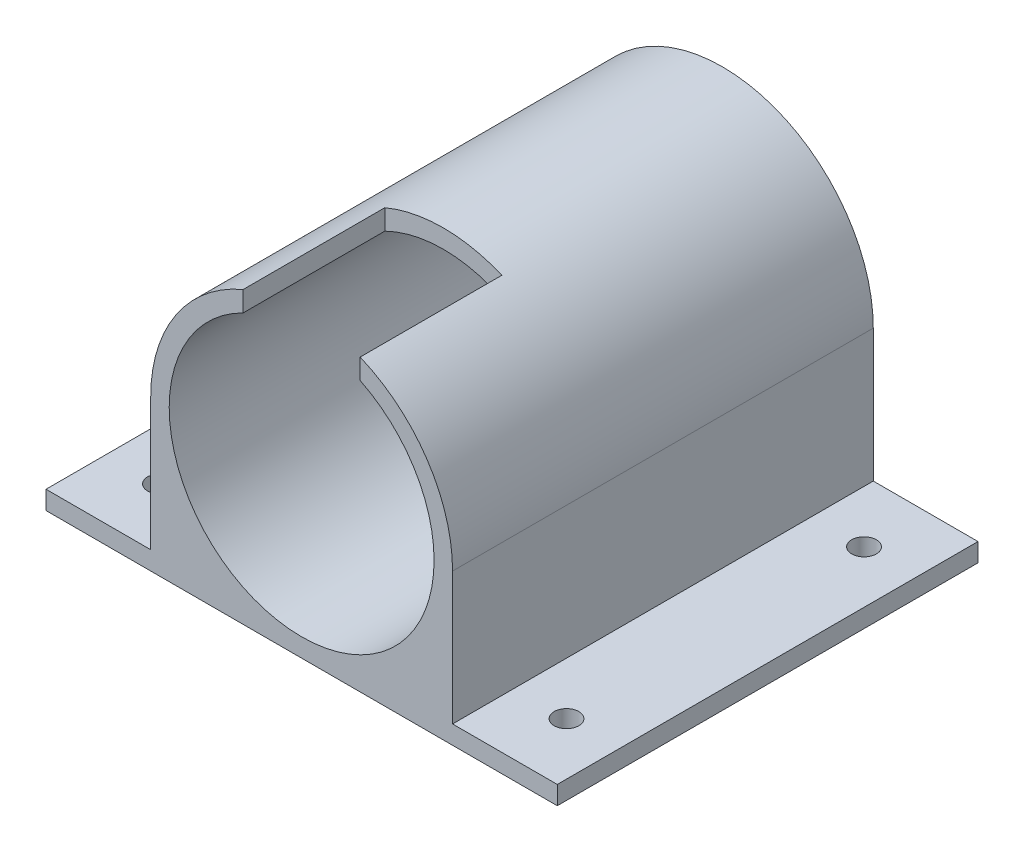
ISO-10303-21;
HEADER;
FILE_DESCRIPTION(('STEP AP214'),'2;1');
FILE_NAME('part.step','',(''),(''),'','','');
FILE_SCHEMA(('AUTOMOTIVE_DESIGN { 1 0 10303 214 1 1 1 1 }'));
ENDSEC;
DATA;
#1=APPLICATION_CONTEXT('core data for automotive mechanical design processes');
#2=APPLICATION_PROTOCOL_DEFINITION('international standard','automotive_design',2000,#1);
#3=PRODUCT_CONTEXT('',#1,'mechanical');
#4=PRODUCT('Part','Part','',(#3));
#5=PRODUCT_RELATED_PRODUCT_CATEGORY('part','',(#4));
#6=PRODUCT_DEFINITION_FORMATION('','',#4);
#7=PRODUCT_DEFINITION_CONTEXT('part definition',#1,'design');
#8=PRODUCT_DEFINITION('design','',#6,#7);
#9=PRODUCT_DEFINITION_SHAPE('','',#8);
#10=(LENGTH_UNIT() NAMED_UNIT(*) SI_UNIT(.MILLI.,.METRE.));
#11=(NAMED_UNIT(*) PLANE_ANGLE_UNIT() SI_UNIT($,.RADIAN.));
#12=(NAMED_UNIT(*) SI_UNIT($,.STERADIAN.) SOLID_ANGLE_UNIT());
#13=UNCERTAINTY_MEASURE_WITH_UNIT(LENGTH_MEASURE(1.E-05),#10,'distance_accuracy_value','');
#14=(GEOMETRIC_REPRESENTATION_CONTEXT(3) GLOBAL_UNCERTAINTY_ASSIGNED_CONTEXT((#13)) GLOBAL_UNIT_ASSIGNED_CONTEXT((#10,
#11,#12)) REPRESENTATION_CONTEXT('',''));
#15=CARTESIAN_POINT('',(0.,0.,0.));
#16=DIRECTION('',(0.,0.,1.));
#17=DIRECTION('',(1.,0.,0.));
#18=AXIS2_PLACEMENT_3D('',#15,#16,#17);
#19=CARTESIAN_POINT('',(24.5,0.,65.3));
#20=DIRECTION('',(-1.,0.,0.));
#21=DIRECTION('',(0.,0.,1.));
#22=AXIS2_PLACEMENT_3D('',#19,#20,#21);
#23=PLANE('',#22);
#24=DIRECTION('',(0.,0.,1.));
#25=VECTOR('',#24,1.);
#26=CARTESIAN_POINT('',(24.5,-21.5,65.3));
#27=LINE('',#26,#25);
#28=CARTESIAN_POINT('',(24.5,-21.5,-3.));
#29=VERTEX_POINT('',#28);
#30=CARTESIAN_POINT('',(24.5,-21.5,65.3));
#31=VERTEX_POINT('',#30);
#32=EDGE_CURVE('E149',#29,#31,#27,.T.);
#33=ORIENTED_EDGE('',*,*,#32,.F.);
#34=DIRECTION('',(0.,-1.,0.));
#35=VECTOR('',#34,1.);
#36=CARTESIAN_POINT('',(24.5,0.,-3.));
#37=LINE('',#36,#35);
#38=CARTESIAN_POINT('',(24.5,0.,-3.));
#39=VERTEX_POINT('',#38);
#40=EDGE_CURVE('E133',#39,#29,#37,.T.);
#41=ORIENTED_EDGE('',*,*,#40,.F.);
#42=DIRECTION('',(0.,0.,-1.));
#43=VECTOR('',#42,1.);
#44=CARTESIAN_POINT('',(24.5,0.,65.3));
#45=LINE('',#44,#43);
#46=CARTESIAN_POINT('',(24.5,0.,65.3));
#47=VERTEX_POINT('',#46);
#48=EDGE_CURVE('E242',#47,#39,#45,.T.);
#49=ORIENTED_EDGE('',*,*,#48,.F.);
#50=DIRECTION('',(0.,1.,0.));
#51=VECTOR('',#50,1.);
#52=CARTESIAN_POINT('',(24.5,0.,65.3));
#53=LINE('',#52,#51);
#54=EDGE_CURVE('E240',#31,#47,#53,.T.);
#55=ORIENTED_EDGE('',*,*,#54,.F.);
#56=EDGE_LOOP('',(#33,#41,#49,#55));
#57=FACE_BOUND('',#56,.T.);
#58=ADVANCED_FACE('F34',(#57),#23,.F.);
#59=CARTESIAN_POINT('',(-24.5,0.,65.3));
#60=DIRECTION('',(-1.,0.,0.));
#61=DIRECTION('',(0.,0.,1.));
#62=AXIS2_PLACEMENT_3D('',#59,#60,#61);
#63=PLANE('',#62);
#64=DIRECTION('',(0.,1.,0.));
#65=VECTOR('',#64,1.);
#66=CARTESIAN_POINT('',(-24.5,0.,-3.));
#67=LINE('',#66,#65);
#68=CARTESIAN_POINT('',(-24.5,-21.5,-3.));
#69=VERTEX_POINT('',#68);
#70=CARTESIAN_POINT('',(-24.5,0.,-3.));
#71=VERTEX_POINT('',#70);
#72=EDGE_CURVE('E132',#69,#71,#67,.T.);
#73=ORIENTED_EDGE('',*,*,#72,.F.);
#74=DIRECTION('',(0.,0.,-1.));
#75=VECTOR('',#74,1.);
#76=CARTESIAN_POINT('',(-24.5,-21.5,-3.));
#77=LINE('',#76,#75);
#78=CARTESIAN_POINT('',(-24.5,-21.5,65.3));
#79=VERTEX_POINT('',#78);
#80=EDGE_CURVE('E162',#79,#69,#77,.T.);
#81=ORIENTED_EDGE('',*,*,#80,.F.);
#82=DIRECTION('',(0.,1.,0.));
#83=VECTOR('',#82,1.);
#84=CARTESIAN_POINT('',(-24.5,0.,65.3));
#85=LINE('',#84,#83);
#86=CARTESIAN_POINT('',(-24.5,0.,65.3));
#87=VERTEX_POINT('',#86);
#88=EDGE_CURVE('E236',#79,#87,#85,.T.);
#89=ORIENTED_EDGE('',*,*,#88,.T.);
#90=DIRECTION('',(0.,0.,-1.));
#91=VECTOR('',#90,1.);
#92=CARTESIAN_POINT('',(-24.5,0.,65.3));
#93=LINE('',#92,#91);
#94=EDGE_CURVE('E246',#87,#71,#93,.T.);
#95=ORIENTED_EDGE('',*,*,#94,.T.);
#96=EDGE_LOOP('',(#73,#81,#89,#95));
#97=FACE_BOUND('',#96,.T.);
#98=ADVANCED_FACE('F281',(#97),#63,.T.);
#99=CARTESIAN_POINT('',(0.,0.,65.3));
#100=DIRECTION('',(0.,0.,-1.));
#101=DIRECTION('',(-1.,0.,0.));
#102=AXIS2_PLACEMENT_3D('',#99,#100,#101);
#103=CYLINDRICAL_SURFACE('',#102,24.5);
#104=CARTESIAN_POINT('',(0.,0.,65.3));
#105=DIRECTION('',(0.,0.,1.));
#106=DIRECTION('',(1.,0.,0.));
#107=AXIS2_PLACEMENT_3D('',#104,#105,#106);
#108=CIRCLE('',#107,24.5);
#109=CARTESIAN_POINT('',(-9.5,22.5831795812724,65.3));
#110=VERTEX_POINT('',#109);
#111=EDGE_CURVE('E232',#110,#87,#108,.T.);
#112=ORIENTED_EDGE('',*,*,#111,.F.);
#113=DIRECTION('',(0.,0.,-1.));
#114=VECTOR('',#113,1.);
#115=CARTESIAN_POINT('',(-9.5,22.5831795812724,65.3));
#116=LINE('',#115,#114);
#117=CARTESIAN_POINT('',(-9.5,22.5831795812724,42.3));
#118=VERTEX_POINT('',#117);
#119=EDGE_CURVE('E188',#110,#118,#116,.T.);
#120=ORIENTED_EDGE('',*,*,#119,.T.);
#121=CARTESIAN_POINT('',(0.,0.,42.3));
#122=DIRECTION('',(0.,0.,-1.));
#123=DIRECTION('',(-1.,0.,0.));
#124=AXIS2_PLACEMENT_3D('',#121,#122,#123);
#125=CIRCLE('',#124,24.5);
#126=CARTESIAN_POINT('',(9.5,22.5831795812724,42.3));
#127=VERTEX_POINT('',#126);
#128=EDGE_CURVE('E191',#118,#127,#125,.T.);
#129=ORIENTED_EDGE('',*,*,#128,.T.);
#130=DIRECTION('',(0.,0.,-1.));
#131=VECTOR('',#130,1.);
#132=CARTESIAN_POINT('',(9.5,22.5831795812724,65.3));
#133=LINE('',#132,#131);
#134=CARTESIAN_POINT('',(9.5,22.5831795812724,65.3));
#135=VERTEX_POINT('',#134);
#136=EDGE_CURVE('E183',#127,#135,#133,.F.);
#137=ORIENTED_EDGE('',*,*,#136,.T.);
#138=EDGE_CURVE('E233',#47,#135,#108,.T.);
#139=ORIENTED_EDGE('',*,*,#138,.F.);
#140=ORIENTED_EDGE('',*,*,#48,.T.);
#141=CARTESIAN_POINT('',(0.,0.,-3.));
#142=DIRECTION('',(0.,0.,-1.));
#143=DIRECTION('',(-1.,0.,0.));
#144=AXIS2_PLACEMENT_3D('',#141,#142,#143);
#145=CIRCLE('',#144,24.5);
#146=EDGE_CURVE('E222',#71,#39,#145,.T.);
#147=ORIENTED_EDGE('',*,*,#146,.F.);
#148=ORIENTED_EDGE('',*,*,#94,.F.);
#149=EDGE_LOOP('',(#112,#120,#129,#137,#139,#140,#147,#148));
#150=FACE_BOUND('',#149,.T.);
#151=ADVANCED_FACE('F264',(#150),#103,.T.);
#152=CARTESIAN_POINT('',(0.,-24.5,65.3));
#153=DIRECTION('',(0.,1.,0.));
#154=DIRECTION('',(0.,0.,1.));
#155=AXIS2_PLACEMENT_3D('',#152,#153,#154);
#156=PLANE('',#155);
#157=CARTESIAN_POINT('',(33.,-24.5,7.));
#158=DIRECTION('',(0.,1.,0.));
#159=DIRECTION('',(0.,0.,1.));
#160=AXIS2_PLACEMENT_3D('',#157,#158,#159);
#161=CIRCLE('',#160,2.);
#162=CARTESIAN_POINT('',(33.,-24.5,9.00000000000001));
#163=VERTEX_POINT('',#162);
#164=EDGE_CURVE('E516',#163,#163,#161,.T.);
#165=ORIENTED_EDGE('',*,*,#164,.T.);
#166=EDGE_LOOP('',(#165));
#167=FACE_BOUND('',#166,.T.);
#168=CARTESIAN_POINT('',(33.,-24.5,55.3));
#169=DIRECTION('',(0.,1.,0.));
#170=DIRECTION('',(0.,0.,1.));
#171=AXIS2_PLACEMENT_3D('',#168,#169,#170);
#172=CIRCLE('',#171,2.);
#173=CARTESIAN_POINT('',(33.,-24.5,57.3));
#174=VERTEX_POINT('',#173);
#175=EDGE_CURVE('E518',#174,#174,#172,.T.);
#176=ORIENTED_EDGE('',*,*,#175,.T.);
#177=EDGE_LOOP('',(#176));
#178=FACE_BOUND('',#177,.T.);
#179=CARTESIAN_POINT('',(-33.,-24.5,7.));
#180=DIRECTION('',(0.,1.,0.));
#181=DIRECTION('',(0.,0.,1.));
#182=AXIS2_PLACEMENT_3D('',#179,#180,#181);
#183=CIRCLE('',#182,2.);
#184=CARTESIAN_POINT('',(-33.,-24.5,9.));
#185=VERTEX_POINT('',#184);
#186=EDGE_CURVE('E151',#185,#185,#183,.T.);
#187=ORIENTED_EDGE('',*,*,#186,.T.);
#188=EDGE_LOOP('',(#187));
#189=FACE_BOUND('',#188,.T.);
#190=CARTESIAN_POINT('',(-33.,-24.5,55.3));
#191=DIRECTION('',(0.,1.,0.));
#192=DIRECTION('',(0.,0.,1.));
#193=AXIS2_PLACEMENT_3D('',#190,#191,#192);
#194=CIRCLE('',#193,2.);
#195=CARTESIAN_POINT('',(-33.,-24.5,57.3));
#196=VERTEX_POINT('',#195);
#197=EDGE_CURVE('E528',#196,#196,#194,.T.);
#198=ORIENTED_EDGE('',*,*,#197,.T.);
#199=EDGE_LOOP('',(#198));
#200=FACE_BOUND('',#199,.T.);
#201=DIRECTION('',(1.,0.,0.));
#202=VECTOR('',#201,1.);
#203=CARTESIAN_POINT('',(0.,-24.5,65.3));
#204=LINE('',#203,#202);
#205=CARTESIAN_POINT('',(-41.5,-24.5,65.3));
#206=VERTEX_POINT('',#205);
#207=CARTESIAN_POINT('',(41.5,-24.5,65.3));
#208=VERTEX_POINT('',#207);
#209=EDGE_CURVE('E238',#206,#208,#204,.T.);
#210=ORIENTED_EDGE('',*,*,#209,.F.);
#211=DIRECTION('',(0.,0.,1.));
#212=VECTOR('',#211,1.);
#213=CARTESIAN_POINT('',(-41.5,-24.5,65.3));
#214=LINE('',#213,#212);
#215=CARTESIAN_POINT('',(-41.5,-24.5,-3.));
#216=VERTEX_POINT('',#215);
#217=EDGE_CURVE('E130',#216,#206,#214,.T.);
#218=ORIENTED_EDGE('',*,*,#217,.F.);
#219=DIRECTION('',(-1.,0.,0.));
#220=VECTOR('',#219,1.);
#221=CARTESIAN_POINT('',(0.,-24.5,-3.));
#222=LINE('',#221,#220);
#223=CARTESIAN_POINT('',(41.5,-24.5,-3.));
#224=VERTEX_POINT('',#223);
#225=EDGE_CURVE('E124',#224,#216,#222,.T.);
#226=ORIENTED_EDGE('',*,*,#225,.F.);
#227=DIRECTION('',(0.,0.,-1.));
#228=VECTOR('',#227,1.);
#229=CARTESIAN_POINT('',(41.5,-24.5,-3.));
#230=LINE('',#229,#228);
#231=EDGE_CURVE('E128',#208,#224,#230,.T.);
#232=ORIENTED_EDGE('',*,*,#231,.F.);
#233=EDGE_LOOP('',(#210,#218,#226,#232));
#234=FACE_BOUND('',#233,.T.);
#235=ADVANCED_FACE('F126',(#167,#178,#189,#200,#234),#156,.F.);
#236=CARTESIAN_POINT('',(0.,0.,65.3));
#237=DIRECTION('',(0.,0.,-1.));
#238=DIRECTION('',(-1.,0.,0.));
#239=AXIS2_PLACEMENT_3D('',#236,#237,#238);
#240=CYLINDRICAL_SURFACE('',#239,21.5);
#241=DIRECTION('',(0.,0.,1.));
#242=VECTOR('',#241,1.);
#243=CARTESIAN_POINT('',(-9.5,19.2873015219859,42.3));
#244=LINE('',#243,#242);
#245=CARTESIAN_POINT('',(-9.5,19.2873015219859,42.3));
#246=VERTEX_POINT('',#245);
#247=CARTESIAN_POINT('',(-9.5,19.2873015219859,65.3));
#248=VERTEX_POINT('',#247);
#249=EDGE_CURVE('E180',#246,#248,#244,.T.);
#250=ORIENTED_EDGE('',*,*,#249,.T.);
#251=CARTESIAN_POINT('',(0.,0.,65.3));
#252=DIRECTION('',(0.,0.,1.));
#253=DIRECTION('',(1.,0.,0.));
#254=AXIS2_PLACEMENT_3D('',#251,#252,#253);
#255=CIRCLE('',#254,21.5);
#256=CARTESIAN_POINT('',(9.5,19.2873015219859,65.3));
#257=VERTEX_POINT('',#256);
#258=EDGE_CURVE('E229',#248,#257,#255,.T.);
#259=ORIENTED_EDGE('',*,*,#258,.T.);
#260=DIRECTION('',(0.,0.,1.));
#261=VECTOR('',#260,1.);
#262=CARTESIAN_POINT('',(9.5,19.2873015219859,42.3));
#263=LINE('',#262,#261);
#264=CARTESIAN_POINT('',(9.5,19.2873015219859,42.3));
#265=VERTEX_POINT('',#264);
#266=EDGE_CURVE('E57',#265,#257,#263,.T.);
#267=ORIENTED_EDGE('',*,*,#266,.F.);
#268=CARTESIAN_POINT('',(0.,0.,42.3));
#269=DIRECTION('',(0.,0.,-1.));
#270=DIRECTION('',(-1.,0.,0.));
#271=AXIS2_PLACEMENT_3D('',#268,#269,#270);
#272=CIRCLE('',#271,21.5);
#273=EDGE_CURVE('E11',#246,#265,#272,.T.);
#274=ORIENTED_EDGE('',*,*,#273,.F.);
#275=EDGE_LOOP('',(#250,#259,#267,#274));
#276=FACE_BOUND('',#275,.T.);
#277=CARTESIAN_POINT('',(0.,0.,0.));
#278=DIRECTION('',(0.,0.,1.));
#279=DIRECTION('',(1.,0.,0.));
#280=AXIS2_PLACEMENT_3D('',#277,#278,#279);
#281=CIRCLE('',#280,21.5);
#282=CARTESIAN_POINT('',(21.5,0.,0.));
#283=VERTEX_POINT('',#282);
#284=EDGE_CURVE('E226',#283,#283,#281,.T.);
#285=ORIENTED_EDGE('',*,*,#284,.F.);
#286=EDGE_LOOP('',(#285));
#287=FACE_BOUND('',#286,.T.);
#288=ADVANCED_FACE('F36',(#276,#287),#240,.F.);
#289=CARTESIAN_POINT('',(0.,0.,65.3));
#290=DIRECTION('',(0.,0.,1.));
#291=DIRECTION('',(1.,0.,0.));
#292=AXIS2_PLACEMENT_3D('',#289,#290,#291);
#293=PLANE('',#292);
#294=DIRECTION('',(0.,-1.,0.));
#295=VECTOR('',#294,1.);
#296=CARTESIAN_POINT('',(-9.5,0.,65.3));
#297=LINE('',#296,#295);
#298=EDGE_CURVE('E42',#110,#248,#297,.T.);
#299=ORIENTED_EDGE('',*,*,#298,.F.);
#300=ORIENTED_EDGE('',*,*,#111,.T.);
#301=ORIENTED_EDGE('',*,*,#88,.F.);
#302=DIRECTION('',(1.,0.,0.));
#303=VECTOR('',#302,1.);
#304=CARTESIAN_POINT('',(-41.5,-21.5,65.3));
#305=LINE('',#304,#303);
#306=CARTESIAN_POINT('',(-41.5,-21.5,65.3));
#307=VERTEX_POINT('',#306);
#308=EDGE_CURVE('E172',#307,#79,#305,.T.);
#309=ORIENTED_EDGE('',*,*,#308,.F.);
#310=DIRECTION('',(0.,1.,0.));
#311=VECTOR('',#310,1.);
#312=CARTESIAN_POINT('',(-41.5,-21.5,65.3));
#313=LINE('',#312,#311);
#314=EDGE_CURVE('E164',#206,#307,#313,.T.);
#315=ORIENTED_EDGE('',*,*,#314,.F.);
#316=ORIENTED_EDGE('',*,*,#209,.T.);
#317=DIRECTION('',(0.,-1.,0.));
#318=VECTOR('',#317,1.);
#319=CARTESIAN_POINT('',(41.5,-24.5,65.3));
#320=LINE('',#319,#318);
#321=CARTESIAN_POINT('',(41.5,-21.5,65.3));
#322=VERTEX_POINT('',#321);
#323=EDGE_CURVE('E148',#322,#208,#320,.T.);
#324=ORIENTED_EDGE('',*,*,#323,.F.);
#325=DIRECTION('',(-1.,0.,0.));
#326=VECTOR('',#325,1.);
#327=CARTESIAN_POINT('',(41.5,-21.5,65.3));
#328=LINE('',#327,#326);
#329=EDGE_CURVE('E157',#322,#31,#328,.T.);
#330=ORIENTED_EDGE('',*,*,#329,.T.);
#331=ORIENTED_EDGE('',*,*,#54,.T.);
#332=ORIENTED_EDGE('',*,*,#138,.T.);
#333=DIRECTION('',(0.,1.,0.));
#334=VECTOR('',#333,1.);
#335=CARTESIAN_POINT('',(9.5,25.0256688603933,65.3));
#336=LINE('',#335,#334);
#337=EDGE_CURVE('E174',#257,#135,#336,.T.);
#338=ORIENTED_EDGE('',*,*,#337,.F.);
#339=ORIENTED_EDGE('',*,*,#258,.F.);
#340=EDGE_LOOP('',(#299,#300,#301,#309,#315,#316,#324,#330,#331,#332,#338,#339));
#341=FACE_BOUND('',#340,.T.);
#342=ADVANCED_FACE('F260',(#341),#293,.T.);
#343=CARTESIAN_POINT('',(0.,0.,0.));
#344=DIRECTION('',(0.,0.,-1.));
#345=DIRECTION('',(-1.,0.,0.));
#346=AXIS2_PLACEMENT_3D('',#343,#344,#345);
#347=PLANE('',#346);
#348=CARTESIAN_POINT('',(17.5,0.,0.));
#349=DIRECTION('',(0.,0.,-1.));
#350=DIRECTION('',(-1.,0.,0.));
#351=AXIS2_PLACEMENT_3D('',#348,#349,#350);
#352=CIRCLE('',#351,1.65);
#353=CARTESIAN_POINT('',(15.85,0.,0.));
#354=VERTEX_POINT('',#353);
#355=EDGE_CURVE('E195',#354,#354,#352,.T.);
#356=ORIENTED_EDGE('',*,*,#355,.T.);
#357=EDGE_LOOP('',(#356));
#358=FACE_BOUND('',#357,.T.);
#359=CARTESIAN_POINT('',(-17.5,0.,0.));
#360=DIRECTION('',(0.,0.,-1.));
#361=DIRECTION('',(-1.,0.,0.));
#362=AXIS2_PLACEMENT_3D('',#359,#360,#361);
#363=CIRCLE('',#362,1.65);
#364=CARTESIAN_POINT('',(-19.15,0.,0.));
#365=VERTEX_POINT('',#364);
#366=EDGE_CURVE('E202',#365,#365,#363,.T.);
#367=ORIENTED_EDGE('',*,*,#366,.T.);
#368=EDGE_LOOP('',(#367));
#369=FACE_BOUND('',#368,.T.);
#370=CARTESIAN_POINT('',(0.,17.5,0.));
#371=DIRECTION('',(0.,0.,-1.));
#372=DIRECTION('',(-1.,0.,0.));
#373=AXIS2_PLACEMENT_3D('',#370,#371,#372);
#374=CIRCLE('',#373,1.65);
#375=CARTESIAN_POINT('',(-1.64999999999999,17.5,0.));
#376=VERTEX_POINT('',#375);
#377=EDGE_CURVE('E208',#376,#376,#374,.T.);
#378=ORIENTED_EDGE('',*,*,#377,.T.);
#379=EDGE_LOOP('',(#378));
#380=FACE_BOUND('',#379,.T.);
#381=CARTESIAN_POINT('',(0.,-17.5,0.));
#382=DIRECTION('',(0.,0.,-1.));
#383=DIRECTION('',(-1.,0.,0.));
#384=AXIS2_PLACEMENT_3D('',#381,#382,#383);
#385=CIRCLE('',#384,1.65);
#386=CARTESIAN_POINT('',(-1.65,-17.5,0.));
#387=VERTEX_POINT('',#386);
#388=EDGE_CURVE('E214',#387,#387,#385,.T.);
#389=ORIENTED_EDGE('',*,*,#388,.T.);
#390=EDGE_LOOP('',(#389));
#391=FACE_BOUND('',#390,.T.);
#392=CARTESIAN_POINT('',(0.,0.,0.));
#393=DIRECTION('',(0.,0.,-1.));
#394=DIRECTION('',(-1.,0.,0.));
#395=AXIS2_PLACEMENT_3D('',#392,#393,#394);
#396=CIRCLE('',#395,14.5);
#397=CARTESIAN_POINT('',(-14.5,0.,0.));
#398=VERTEX_POINT('',#397);
#399=EDGE_CURVE('E198',#398,#398,#396,.T.);
#400=ORIENTED_EDGE('',*,*,#399,.T.);
#401=EDGE_LOOP('',(#400));
#402=FACE_BOUND('',#401,.T.);
#403=ORIENTED_EDGE('',*,*,#284,.T.);
#404=EDGE_LOOP('',(#403));
#405=FACE_BOUND('',#404,.T.);
#406=ADVANCED_FACE('F318',(#358,#369,#380,#391,#402,#405),#347,.F.);
#407=CARTESIAN_POINT('',(0.,0.,-3.));
#408=DIRECTION('',(0.,0.,1.));
#409=DIRECTION('',(1.,0.,0.));
#410=AXIS2_PLACEMENT_3D('',#407,#408,#409);
#411=CYLINDRICAL_SURFACE('',#410,14.5);
#412=CARTESIAN_POINT('',(0.,0.,-3.));
#413=DIRECTION('',(0.,0.,-1.));
#414=DIRECTION('',(-1.,0.,0.));
#415=AXIS2_PLACEMENT_3D('',#412,#413,#414);
#416=CIRCLE('',#415,14.5);
#417=CARTESIAN_POINT('',(-14.5,0.,-3.));
#418=VERTEX_POINT('',#417);
#419=EDGE_CURVE('E219',#418,#418,#416,.T.);
#420=ORIENTED_EDGE('',*,*,#419,.T.);
#421=EDGE_LOOP('',(#420));
#422=FACE_BOUND('',#421,.T.);
#423=ORIENTED_EDGE('',*,*,#399,.F.);
#424=EDGE_LOOP('',(#423));
#425=FACE_BOUND('',#424,.T.);
#426=ADVANCED_FACE('F325',(#422,#425),#411,.F.);
#427=CARTESIAN_POINT('',(0.,0.,-3.));
#428=DIRECTION('',(0.,0.,-1.));
#429=DIRECTION('',(-1.,0.,0.));
#430=AXIS2_PLACEMENT_3D('',#427,#428,#429);
#431=PLANE('',#430);
#432=CARTESIAN_POINT('',(17.5,0.,-3.));
#433=DIRECTION('',(0.,0.,-1.));
#434=DIRECTION('',(-1.,0.,0.));
#435=AXIS2_PLACEMENT_3D('',#432,#433,#434);
#436=CIRCLE('',#435,1.65);
#437=CARTESIAN_POINT('',(15.85,0.,-3.));
#438=VERTEX_POINT('',#437);
#439=EDGE_CURVE('E199',#438,#438,#436,.T.);
#440=ORIENTED_EDGE('',*,*,#439,.F.);
#441=EDGE_LOOP('',(#440));
#442=FACE_BOUND('',#441,.T.);
#443=CARTESIAN_POINT('',(-17.5,0.,-3.));
#444=DIRECTION('',(0.,0.,-1.));
#445=DIRECTION('',(-1.,0.,0.));
#446=AXIS2_PLACEMENT_3D('',#443,#444,#445);
#447=CIRCLE('',#446,1.65);
#448=CARTESIAN_POINT('',(-19.15,0.,-3.));
#449=VERTEX_POINT('',#448);
#450=EDGE_CURVE('E205',#449,#449,#447,.T.);
#451=ORIENTED_EDGE('',*,*,#450,.F.);
#452=EDGE_LOOP('',(#451));
#453=FACE_BOUND('',#452,.T.);
#454=CARTESIAN_POINT('',(0.,17.5,-3.));
#455=DIRECTION('',(0.,0.,-1.));
#456=DIRECTION('',(-1.,0.,0.));
#457=AXIS2_PLACEMENT_3D('',#454,#455,#456);
#458=CIRCLE('',#457,1.65);
#459=CARTESIAN_POINT('',(-1.64999999999999,17.5,-3.));
#460=VERTEX_POINT('',#459);
#461=EDGE_CURVE('E211',#460,#460,#458,.T.);
#462=ORIENTED_EDGE('',*,*,#461,.F.);
#463=EDGE_LOOP('',(#462));
#464=FACE_BOUND('',#463,.T.);
#465=CARTESIAN_POINT('',(0.,-17.5,-3.));
#466=DIRECTION('',(0.,0.,-1.));
#467=DIRECTION('',(-1.,0.,0.));
#468=AXIS2_PLACEMENT_3D('',#465,#466,#467);
#469=CIRCLE('',#468,1.65);
#470=CARTESIAN_POINT('',(-1.65,-17.5,-3.));
#471=VERTEX_POINT('',#470);
#472=EDGE_CURVE('E194',#471,#471,#469,.T.);
#473=ORIENTED_EDGE('',*,*,#472,.F.);
#474=EDGE_LOOP('',(#473));
#475=FACE_BOUND('',#474,.T.);
#476=ORIENTED_EDGE('',*,*,#419,.F.);
#477=EDGE_LOOP('',(#476));
#478=FACE_BOUND('',#477,.T.);
#479=ORIENTED_EDGE('',*,*,#146,.T.);
#480=ORIENTED_EDGE('',*,*,#40,.T.);
#481=DIRECTION('',(-1.,0.,0.));
#482=VECTOR('',#481,1.);
#483=CARTESIAN_POINT('',(41.5,-21.5,-3.));
#484=LINE('',#483,#482);
#485=CARTESIAN_POINT('',(41.5,-21.5,-3.));
#486=VERTEX_POINT('',#485);
#487=EDGE_CURVE('E140',#486,#29,#484,.T.);
#488=ORIENTED_EDGE('',*,*,#487,.F.);
#489=DIRECTION('',(0.,1.,0.));
#490=VECTOR('',#489,1.);
#491=CARTESIAN_POINT('',(41.5,-21.5,-3.));
#492=LINE('',#491,#490);
#493=EDGE_CURVE('E136',#224,#486,#492,.T.);
#494=ORIENTED_EDGE('',*,*,#493,.F.);
#495=ORIENTED_EDGE('',*,*,#225,.T.);
#496=DIRECTION('',(0.,-1.,0.));
#497=VECTOR('',#496,1.);
#498=CARTESIAN_POINT('',(-41.5,-24.5,-3.));
#499=LINE('',#498,#497);
#500=CARTESIAN_POINT('',(-41.5,-21.5,-3.));
#501=VERTEX_POINT('',#500);
#502=EDGE_CURVE('E168',#501,#216,#499,.T.);
#503=ORIENTED_EDGE('',*,*,#502,.F.);
#504=DIRECTION('',(1.,0.,0.));
#505=VECTOR('',#504,1.);
#506=CARTESIAN_POINT('',(-41.5,-21.5,-3.));
#507=LINE('',#506,#505);
#508=EDGE_CURVE('E49',#501,#69,#507,.T.);
#509=ORIENTED_EDGE('',*,*,#508,.T.);
#510=ORIENTED_EDGE('',*,*,#72,.T.);
#511=EDGE_LOOP('',(#479,#480,#488,#494,#495,#503,#509,#510));
#512=FACE_BOUND('',#511,.T.);
#513=ADVANCED_FACE('F138',(#442,#453,#464,#475,#478,#512),#431,.T.);
#514=CARTESIAN_POINT('',(0.,-17.5,0.));
#515=DIRECTION('',(0.,0.,-1.));
#516=DIRECTION('',(-1.,0.,0.));
#517=AXIS2_PLACEMENT_3D('',#514,#515,#516);
#518=CYLINDRICAL_SURFACE('',#517,1.65);
#519=ORIENTED_EDGE('',*,*,#388,.F.);
#520=EDGE_LOOP('',(#519));
#521=FACE_BOUND('',#520,.T.);
#522=ORIENTED_EDGE('',*,*,#472,.T.);
#523=EDGE_LOOP('',(#522));
#524=FACE_BOUND('',#523,.T.);
#525=ADVANCED_FACE('F339',(#521,#524),#518,.F.);
#526=CARTESIAN_POINT('',(0.,17.5,0.));
#527=DIRECTION('',(0.,0.,-1.));
#528=DIRECTION('',(-1.,0.,0.));
#529=AXIS2_PLACEMENT_3D('',#526,#527,#528);
#530=CYLINDRICAL_SURFACE('',#529,1.65);
#531=ORIENTED_EDGE('',*,*,#377,.F.);
#532=EDGE_LOOP('',(#531));
#533=FACE_BOUND('',#532,.T.);
#534=ORIENTED_EDGE('',*,*,#461,.T.);
#535=EDGE_LOOP('',(#534));
#536=FACE_BOUND('',#535,.T.);
#537=ADVANCED_FACE('F347',(#533,#536),#530,.F.);
#538=CARTESIAN_POINT('',(-17.5,0.,0.));
#539=DIRECTION('',(0.,0.,-1.));
#540=DIRECTION('',(-1.,0.,0.));
#541=AXIS2_PLACEMENT_3D('',#538,#539,#540);
#542=CYLINDRICAL_SURFACE('',#541,1.65);
#543=ORIENTED_EDGE('',*,*,#366,.F.);
#544=EDGE_LOOP('',(#543));
#545=FACE_BOUND('',#544,.T.);
#546=ORIENTED_EDGE('',*,*,#450,.T.);
#547=EDGE_LOOP('',(#546));
#548=FACE_BOUND('',#547,.T.);
#549=ADVANCED_FACE('F275',(#545,#548),#542,.F.);
#550=CARTESIAN_POINT('',(17.5,0.,0.));
#551=DIRECTION('',(0.,0.,-1.));
#552=DIRECTION('',(-1.,0.,0.));
#553=AXIS2_PLACEMENT_3D('',#550,#551,#552);
#554=CYLINDRICAL_SURFACE('',#553,1.65);
#555=ORIENTED_EDGE('',*,*,#355,.F.);
#556=EDGE_LOOP('',(#555));
#557=FACE_BOUND('',#556,.T.);
#558=ORIENTED_EDGE('',*,*,#439,.T.);
#559=EDGE_LOOP('',(#558));
#560=FACE_BOUND('',#559,.T.);
#561=ADVANCED_FACE('F268',(#557,#560),#554,.F.);
#562=CARTESIAN_POINT('',(0.,0.,42.3));
#563=DIRECTION('',(0.,0.,-1.));
#564=DIRECTION('',(-1.,0.,0.));
#565=AXIS2_PLACEMENT_3D('',#562,#563,#564);
#566=PLANE('',#565);
#567=DIRECTION('',(0.,-1.,0.));
#568=VECTOR('',#567,1.);
#569=CARTESIAN_POINT('',(-9.5,19.2873015219859,42.3));
#570=LINE('',#569,#568);
#571=EDGE_CURVE('E175',#118,#246,#570,.T.);
#572=ORIENTED_EDGE('',*,*,#571,.T.);
#573=ORIENTED_EDGE('',*,*,#273,.T.);
#574=DIRECTION('',(0.,1.,0.));
#575=VECTOR('',#574,1.);
#576=CARTESIAN_POINT('',(9.5,25.0256688603933,42.3));
#577=LINE('',#576,#575);
#578=EDGE_CURVE('E177',#265,#127,#577,.T.);
#579=ORIENTED_EDGE('',*,*,#578,.T.);
#580=ORIENTED_EDGE('',*,*,#128,.F.);
#581=EDGE_LOOP('',(#572,#573,#579,#580));
#582=FACE_BOUND('',#581,.T.);
#583=ADVANCED_FACE('F266',(#582),#566,.F.);
#584=CARTESIAN_POINT('',(-9.5,19.2873015219859,42.3));
#585=DIRECTION('',(-1.,0.,0.));
#586=DIRECTION('',(0.,0.,1.));
#587=AXIS2_PLACEMENT_3D('',#584,#585,#586);
#588=PLANE('',#587);
#589=ORIENTED_EDGE('',*,*,#298,.T.);
#590=ORIENTED_EDGE('',*,*,#249,.F.);
#591=ORIENTED_EDGE('',*,*,#571,.F.);
#592=ORIENTED_EDGE('',*,*,#119,.F.);
#593=EDGE_LOOP('',(#589,#590,#591,#592));
#594=FACE_BOUND('',#593,.T.);
#595=ADVANCED_FACE('F251',(#594),#588,.F.);
#596=CARTESIAN_POINT('',(9.5,25.0256688603933,42.3));
#597=DIRECTION('',(1.,0.,0.));
#598=DIRECTION('',(0.,0.,-1.));
#599=AXIS2_PLACEMENT_3D('',#596,#597,#598);
#600=PLANE('',#599);
#601=ORIENTED_EDGE('',*,*,#578,.F.);
#602=ORIENTED_EDGE('',*,*,#266,.T.);
#603=ORIENTED_EDGE('',*,*,#337,.T.);
#604=ORIENTED_EDGE('',*,*,#136,.F.);
#605=EDGE_LOOP('',(#601,#602,#603,#604));
#606=FACE_BOUND('',#605,.T.);
#607=ADVANCED_FACE('F262',(#606),#600,.F.);
#608=CARTESIAN_POINT('',(-41.5,-21.5,-3.));
#609=DIRECTION('',(0.,-1.,0.));
#610=DIRECTION('',(0.,0.,-1.));
#611=AXIS2_PLACEMENT_3D('',#608,#609,#610);
#612=PLANE('',#611);
#613=CARTESIAN_POINT('',(-33.,-21.5,7.));
#614=DIRECTION('',(0.,1.,0.));
#615=DIRECTION('',(0.,0.,1.));
#616=AXIS2_PLACEMENT_3D('',#613,#614,#615);
#617=CIRCLE('',#616,2.);
#618=CARTESIAN_POINT('',(-33.,-21.5,9.));
#619=VERTEX_POINT('',#618);
#620=EDGE_CURVE('E521',#619,#619,#617,.T.);
#621=ORIENTED_EDGE('',*,*,#620,.F.);
#622=EDGE_LOOP('',(#621));
#623=FACE_BOUND('',#622,.T.);
#624=CARTESIAN_POINT('',(-33.,-21.5,55.3));
#625=DIRECTION('',(0.,1.,0.));
#626=DIRECTION('',(0.,0.,1.));
#627=AXIS2_PLACEMENT_3D('',#624,#625,#626);
#628=CIRCLE('',#627,2.);
#629=CARTESIAN_POINT('',(-33.,-21.5,57.3));
#630=VERTEX_POINT('',#629);
#631=EDGE_CURVE('E517',#630,#630,#628,.T.);
#632=ORIENTED_EDGE('',*,*,#631,.F.);
#633=EDGE_LOOP('',(#632));
#634=FACE_BOUND('',#633,.T.);
#635=ORIENTED_EDGE('',*,*,#80,.T.);
#636=ORIENTED_EDGE('',*,*,#508,.F.);
#637=DIRECTION('',(0.,0.,-1.));
#638=VECTOR('',#637,1.);
#639=CARTESIAN_POINT('',(-41.5,-21.5,-3.));
#640=LINE('',#639,#638);
#641=EDGE_CURVE('E166',#307,#501,#640,.T.);
#642=ORIENTED_EDGE('',*,*,#641,.F.);
#643=ORIENTED_EDGE('',*,*,#308,.T.);
#644=EDGE_LOOP('',(#635,#636,#642,#643));
#645=FACE_BOUND('',#644,.T.);
#646=ADVANCED_FACE('F387',(#623,#634,#645),#612,.F.);
#647=CARTESIAN_POINT('',(-41.5,0.,0.));
#648=DIRECTION('',(1.,0.,0.));
#649=DIRECTION('',(0.,0.,-1.));
#650=AXIS2_PLACEMENT_3D('',#647,#648,#649);
#651=PLANE('',#650);
#652=ORIENTED_EDGE('',*,*,#217,.T.);
#653=ORIENTED_EDGE('',*,*,#314,.T.);
#654=ORIENTED_EDGE('',*,*,#641,.T.);
#655=ORIENTED_EDGE('',*,*,#502,.T.);
#656=EDGE_LOOP('',(#652,#653,#654,#655));
#657=FACE_BOUND('',#656,.T.);
#658=ADVANCED_FACE('F436',(#657),#651,.F.);
#659=CARTESIAN_POINT('',(41.5,-21.5,65.3));
#660=DIRECTION('',(0.,-1.,0.));
#661=DIRECTION('',(0.,0.,-1.));
#662=AXIS2_PLACEMENT_3D('',#659,#660,#661);
#663=PLANE('',#662);
#664=CARTESIAN_POINT('',(33.,-21.5,7.));
#665=DIRECTION('',(0.,1.,0.));
#666=DIRECTION('',(0.,0.,1.));
#667=AXIS2_PLACEMENT_3D('',#664,#665,#666);
#668=CIRCLE('',#667,2.);
#669=CARTESIAN_POINT('',(33.,-21.5,9.));
#670=VERTEX_POINT('',#669);
#671=EDGE_CURVE('E513',#670,#670,#668,.T.);
#672=ORIENTED_EDGE('',*,*,#671,.F.);
#673=EDGE_LOOP('',(#672));
#674=FACE_BOUND('',#673,.T.);
#675=CARTESIAN_POINT('',(33.,-21.5,55.3));
#676=DIRECTION('',(0.,1.,0.));
#677=DIRECTION('',(0.,0.,1.));
#678=AXIS2_PLACEMENT_3D('',#675,#676,#677);
#679=CIRCLE('',#678,2.);
#680=CARTESIAN_POINT('',(33.,-21.5,57.3));
#681=VERTEX_POINT('',#680);
#682=EDGE_CURVE('E554',#681,#681,#679,.T.);
#683=ORIENTED_EDGE('',*,*,#682,.F.);
#684=EDGE_LOOP('',(#683));
#685=FACE_BOUND('',#684,.T.);
#686=ORIENTED_EDGE('',*,*,#32,.T.);
#687=ORIENTED_EDGE('',*,*,#329,.F.);
#688=DIRECTION('',(0.,0.,1.));
#689=VECTOR('',#688,1.);
#690=CARTESIAN_POINT('',(41.5,-21.5,65.3));
#691=LINE('',#690,#689);
#692=EDGE_CURVE('E143',#486,#322,#691,.T.);
#693=ORIENTED_EDGE('',*,*,#692,.F.);
#694=ORIENTED_EDGE('',*,*,#487,.T.);
#695=EDGE_LOOP('',(#686,#687,#693,#694));
#696=FACE_BOUND('',#695,.T.);
#697=ADVANCED_FACE('F444',(#674,#685,#696),#663,.F.);
#698=CARTESIAN_POINT('',(41.5,0.,0.));
#699=DIRECTION('',(-1.,0.,0.));
#700=DIRECTION('',(0.,0.,1.));
#701=AXIS2_PLACEMENT_3D('',#698,#699,#700);
#702=PLANE('',#701);
#703=ORIENTED_EDGE('',*,*,#231,.T.);
#704=ORIENTED_EDGE('',*,*,#493,.T.);
#705=ORIENTED_EDGE('',*,*,#692,.T.);
#706=ORIENTED_EDGE('',*,*,#323,.T.);
#707=EDGE_LOOP('',(#703,#704,#705,#706));
#708=FACE_BOUND('',#707,.T.);
#709=ADVANCED_FACE('F146',(#708),#702,.F.);
#710=CARTESIAN_POINT('',(-33.,-31.5,55.3));
#711=DIRECTION('',(0.,1.,0.));
#712=DIRECTION('',(0.,0.,1.));
#713=AXIS2_PLACEMENT_3D('',#710,#711,#712);
#714=CYLINDRICAL_SURFACE('',#713,2.);
#715=ORIENTED_EDGE('',*,*,#631,.T.);
#716=EDGE_LOOP('',(#715));
#717=FACE_BOUND('',#716,.T.);
#718=ORIENTED_EDGE('',*,*,#197,.F.);
#719=EDGE_LOOP('',(#718));
#720=FACE_BOUND('',#719,.T.);
#721=ADVANCED_FACE('F467',(#717,#720),#714,.F.);
#722=CARTESIAN_POINT('',(-33.,-31.5,7.));
#723=DIRECTION('',(0.,1.,0.));
#724=DIRECTION('',(0.,0.,1.));
#725=AXIS2_PLACEMENT_3D('',#722,#723,#724);
#726=CYLINDRICAL_SURFACE('',#725,2.);
#727=ORIENTED_EDGE('',*,*,#620,.T.);
#728=EDGE_LOOP('',(#727));
#729=FACE_BOUND('',#728,.T.);
#730=ORIENTED_EDGE('',*,*,#186,.F.);
#731=EDGE_LOOP('',(#730));
#732=FACE_BOUND('',#731,.T.);
#733=ADVANCED_FACE('F473',(#729,#732),#726,.F.);
#734=CARTESIAN_POINT('',(33.,-31.5,55.3));
#735=DIRECTION('',(0.,1.,0.));
#736=DIRECTION('',(0.,0.,1.));
#737=AXIS2_PLACEMENT_3D('',#734,#735,#736);
#738=CYLINDRICAL_SURFACE('',#737,2.);
#739=ORIENTED_EDGE('',*,*,#682,.T.);
#740=EDGE_LOOP('',(#739));
#741=FACE_BOUND('',#740,.T.);
#742=ORIENTED_EDGE('',*,*,#175,.F.);
#743=EDGE_LOOP('',(#742));
#744=FACE_BOUND('',#743,.T.);
#745=ADVANCED_FACE('F480',(#741,#744),#738,.F.);
#746=CARTESIAN_POINT('',(33.,-31.5,7.));
#747=DIRECTION('',(0.,1.,0.));
#748=DIRECTION('',(0.,0.,1.));
#749=AXIS2_PLACEMENT_3D('',#746,#747,#748);
#750=CYLINDRICAL_SURFACE('',#749,2.);
#751=ORIENTED_EDGE('',*,*,#671,.T.);
#752=EDGE_LOOP('',(#751));
#753=FACE_BOUND('',#752,.T.);
#754=ORIENTED_EDGE('',*,*,#164,.F.);
#755=EDGE_LOOP('',(#754));
#756=FACE_BOUND('',#755,.T.);
#757=ADVANCED_FACE('F487',(#753,#756),#750,.F.);
#758=CLOSED_SHELL('',(#58,#98,#151,#235,#288,#342,#406,#426,#513,#525,#537,#549,#561,#583,#595,
#607,#646,#658,#697,#709,#721,#733,#745,#757));
#759=MANIFOLD_SOLID_BREP('B2',#758);
#760=ADVANCED_BREP_SHAPE_REPRESENTATION('',(#18,#759),#14);
#761=SHAPE_DEFINITION_REPRESENTATION(#9,#760);
ENDSEC;
END-ISO-10303-21;
